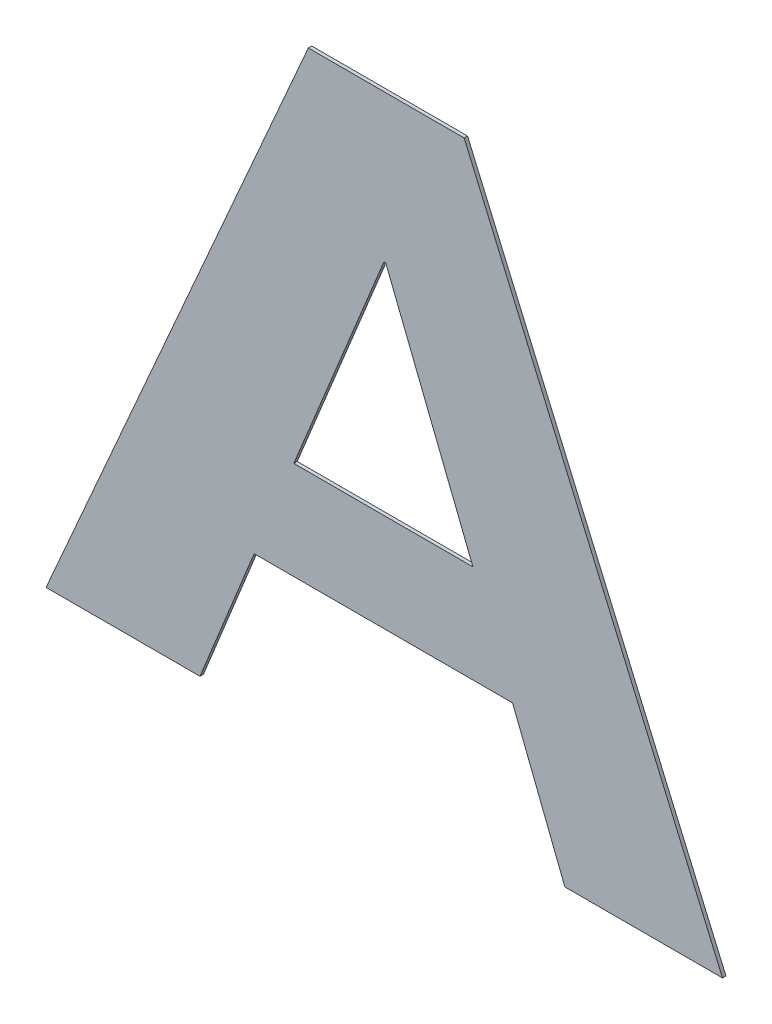
ISO-10303-21;
HEADER;
FILE_DESCRIPTION(('STEP AP214'),'2;1');
FILE_NAME('part.step','',(''),(''),'','','');
FILE_SCHEMA(('AUTOMOTIVE_DESIGN { 1 0 10303 214 1 1 1 1 }'));
ENDSEC;
DATA;
#1=APPLICATION_CONTEXT('core data for automotive mechanical design processes');
#2=APPLICATION_PROTOCOL_DEFINITION('international standard','automotive_design',2000,#1);
#3=PRODUCT_CONTEXT('',#1,'mechanical');
#4=PRODUCT('Part','Part','',(#3));
#5=PRODUCT_RELATED_PRODUCT_CATEGORY('part','',(#4));
#6=PRODUCT_DEFINITION_FORMATION('','',#4);
#7=PRODUCT_DEFINITION_CONTEXT('part definition',#1,'design');
#8=PRODUCT_DEFINITION('design','',#6,#7);
#9=PRODUCT_DEFINITION_SHAPE('','',#8);
#10=(LENGTH_UNIT() NAMED_UNIT(*) SI_UNIT(.MILLI.,.METRE.));
#11=(NAMED_UNIT(*) PLANE_ANGLE_UNIT() SI_UNIT($,.RADIAN.));
#12=(NAMED_UNIT(*) SI_UNIT($,.STERADIAN.) SOLID_ANGLE_UNIT());
#13=UNCERTAINTY_MEASURE_WITH_UNIT(LENGTH_MEASURE(1.E-05),#10,'distance_accuracy_value','');
#14=(GEOMETRIC_REPRESENTATION_CONTEXT(3) GLOBAL_UNCERTAINTY_ASSIGNED_CONTEXT((#13)) GLOBAL_UNIT_ASSIGNED_CONTEXT((#10,
#11,#12)) REPRESENTATION_CONTEXT('',''));
#15=CARTESIAN_POINT('',(0.,0.,0.));
#16=DIRECTION('',(0.,0.,1.));
#17=DIRECTION('',(1.,0.,0.));
#18=AXIS2_PLACEMENT_3D('',#15,#16,#17);
#19=CARTESIAN_POINT('',(-0.0104724210323502,0.92595557828035,0.00015));
#20=DIRECTION('',(0.,1.,0.));
#21=DIRECTION('',(0.,0.,1.));
#22=AXIS2_PLACEMENT_3D('',#19,#20,#21);
#23=PLANE('',#22);
#24=DIRECTION('',(0.,0.,1.));
#25=VECTOR('',#24,1.);
#26=CARTESIAN_POINT('',(-0.0138923976823502,0.92595557828035,0.));
#27=LINE('',#26,#25);
#28=CARTESIAN_POINT('',(-0.0138923976823502,0.92595557828035,0.));
#29=VERTEX_POINT('',#28);
#30=CARTESIAN_POINT('',(-0.0138923976823502,0.92595557828035,0.00015));
#31=VERTEX_POINT('',#30);
#32=EDGE_CURVE('E11',#29,#31,#27,.T.);
#33=ORIENTED_EDGE('',*,*,#32,.T.);
#34=DIRECTION('',(1.,0.,0.));
#35=VECTOR('',#34,1.);
#36=CARTESIAN_POINT('',(-0.0138923976823502,0.92595557828035,0.00015));
#37=LINE('',#36,#35);
#38=CARTESIAN_POINT('',(-0.00705244438235018,0.92595557828035,0.00015));
#39=VERTEX_POINT('',#38);
#40=EDGE_CURVE('E24',#31,#39,#37,.T.);
#41=ORIENTED_EDGE('',*,*,#40,.T.);
#42=DIRECTION('',(0.,0.,1.));
#43=VECTOR('',#42,1.);
#44=CARTESIAN_POINT('',(-0.00705244438235018,0.92595557828035,0.));
#45=LINE('',#44,#43);
#46=CARTESIAN_POINT('',(-0.00705244438235018,0.92595557828035,0.));
#47=VERTEX_POINT('',#46);
#48=EDGE_CURVE('E200',#47,#39,#45,.T.);
#49=ORIENTED_EDGE('',*,*,#48,.F.);
#50=DIRECTION('',(1.,0.,0.));
#51=VECTOR('',#50,1.);
#52=CARTESIAN_POINT('',(-0.0138923976823502,0.92595557828035,0.));
#53=LINE('',#52,#51);
#54=EDGE_CURVE('E197',#29,#47,#53,.T.);
#55=ORIENTED_EDGE('',*,*,#54,.F.);
#56=EDGE_LOOP('',(#33,#41,#49,#55));
#57=FACE_BOUND('',#56,.T.);
#58=ADVANCED_FACE('F17',(#57),#23,.T.);
#59=CARTESIAN_POINT('',(-0.00138070164067517,0.9128238842195,0.00015));
#60=DIRECTION('',(0.918030838804518,0.3965089898147,0.));
#61=DIRECTION('',(0.,0.,-1.));
#62=AXIS2_PLACEMENT_3D('',#59,#60,#61);
#63=PLANE('',#62);
#64=ORIENTED_EDGE('',*,*,#48,.T.);
#65=DIRECTION('',(0.3965089898147,-0.918030838804518,0.));
#66=VECTOR('',#65,1.);
#67=CARTESIAN_POINT('',(-0.00705244438235018,0.92595557828035,0.00015));
#68=LINE('',#67,#66);
#69=CARTESIAN_POINT('',(0.00429104110099982,0.89969219015865,0.00015));
#70=VERTEX_POINT('',#69);
#71=EDGE_CURVE('E195',#39,#70,#68,.T.);
#72=ORIENTED_EDGE('',*,*,#71,.T.);
#73=DIRECTION('',(0.,0.,1.));
#74=VECTOR('',#73,1.);
#75=CARTESIAN_POINT('',(0.00429104110099982,0.89969219015865,0.));
#76=LINE('',#75,#74);
#77=CARTESIAN_POINT('',(0.00429104110099982,0.89969219015865,0.));
#78=VERTEX_POINT('',#77);
#79=EDGE_CURVE('E192',#78,#70,#76,.T.);
#80=ORIENTED_EDGE('',*,*,#79,.F.);
#81=DIRECTION('',(0.3965089898147,-0.918030838804518,0.));
#82=VECTOR('',#81,1.);
#83=CARTESIAN_POINT('',(-0.00705244438235018,0.92595557828035,0.));
#84=LINE('',#83,#82);
#85=EDGE_CURVE('E189',#47,#78,#84,.T.);
#86=ORIENTED_EDGE('',*,*,#85,.F.);
#87=EDGE_LOOP('',(#64,#72,#80,#86));
#88=FACE_BOUND('',#87,.T.);
#89=ADVANCED_FACE('F207',(#88),#63,.T.);
#90=CARTESIAN_POINT('',(0.000830431859324817,0.89969219015865,0.00015));
#91=DIRECTION('',(0.,-1.,0.));
#92=DIRECTION('',(0.,0.,-1.));
#93=AXIS2_PLACEMENT_3D('',#90,#91,#92);
#94=PLANE('',#93);
#95=ORIENTED_EDGE('',*,*,#79,.T.);
#96=DIRECTION('',(-1.,0.,0.));
#97=VECTOR('',#96,1.);
#98=CARTESIAN_POINT('',(0.00429104110099982,0.89969219015865,0.00015));
#99=LINE('',#98,#97);
#100=CARTESIAN_POINT('',(-0.00263017738235018,0.89969219015865,0.00015));
#101=VERTEX_POINT('',#100);
#102=EDGE_CURVE('E187',#70,#101,#99,.T.);
#103=ORIENTED_EDGE('',*,*,#102,.T.);
#104=DIRECTION('',(0.,0.,1.));
#105=VECTOR('',#104,1.);
#106=CARTESIAN_POINT('',(-0.00263017738235018,0.89969219015865,0.));
#107=LINE('',#106,#105);
#108=CARTESIAN_POINT('',(-0.00263017738235018,0.89969219015865,0.));
#109=VERTEX_POINT('',#108);
#110=EDGE_CURVE('E184',#109,#101,#107,.T.);
#111=ORIENTED_EDGE('',*,*,#110,.F.);
#112=DIRECTION('',(-1.,0.,0.));
#113=VECTOR('',#112,1.);
#114=CARTESIAN_POINT('',(0.00429104110099982,0.89969219015865,0.));
#115=LINE('',#114,#113);
#116=EDGE_CURVE('E181',#78,#109,#115,.T.);
#117=ORIENTED_EDGE('',*,*,#116,.F.);
#118=EDGE_LOOP('',(#95,#103,#111,#117));
#119=FACE_BOUND('',#118,.T.);
#120=ADVANCED_FACE('F214',(#119),#94,.T.);
#121=CARTESIAN_POINT('',(-0.00377807111567518,0.9026167780145,0.00015));
#122=DIRECTION('',(-0.930865350415299,-0.365362421981521,0.));
#123=DIRECTION('',(0.,0.,1.));
#124=AXIS2_PLACEMENT_3D('',#121,#122,#123);
#125=PLANE('',#124);
#126=ORIENTED_EDGE('',*,*,#110,.T.);
#127=DIRECTION('',(-0.365362421981521,0.930865350415299,0.));
#128=VECTOR('',#127,1.);
#129=CARTESIAN_POINT('',(-0.00263017738235018,0.89969219015865,0.00015));
#130=LINE('',#129,#128);
#131=CARTESIAN_POINT('',(-0.00492596484900018,0.90554136587035,0.00015));
#132=VERTEX_POINT('',#131);
#133=EDGE_CURVE('E179',#101,#132,#130,.T.);
#134=ORIENTED_EDGE('',*,*,#133,.T.);
#135=DIRECTION('',(0.,0.,1.));
#136=VECTOR('',#135,1.);
#137=CARTESIAN_POINT('',(-0.00492596484900018,0.90554136587035,0.));
#138=LINE('',#137,#136);
#139=CARTESIAN_POINT('',(-0.00492596484900018,0.90554136587035,0.));
#140=VERTEX_POINT('',#139);
#141=EDGE_CURVE('E176',#140,#132,#138,.T.);
#142=ORIENTED_EDGE('',*,*,#141,.F.);
#143=DIRECTION('',(-0.365362421981521,0.930865350415299,0.));
#144=VECTOR('',#143,1.);
#145=CARTESIAN_POINT('',(-0.00263017738235018,0.89969219015865,0.));
#146=LINE('',#145,#144);
#147=EDGE_CURVE('E173',#109,#140,#146,.T.);
#148=ORIENTED_EDGE('',*,*,#147,.F.);
#149=EDGE_LOOP('',(#126,#134,#142,#148));
#150=FACE_BOUND('',#149,.T.);
#151=ADVANCED_FACE('F218',(#150),#125,.T.);
#152=CARTESIAN_POINT('',(-0.0105977075906752,0.90554136587035,0.00015));
#153=DIRECTION('',(0.,-1.,0.));
#154=DIRECTION('',(0.,0.,-1.));
#155=AXIS2_PLACEMENT_3D('',#152,#153,#154);
#156=PLANE('',#155);
#157=ORIENTED_EDGE('',*,*,#141,.T.);
#158=DIRECTION('',(-1.,0.,0.));
#159=VECTOR('',#158,1.);
#160=CARTESIAN_POINT('',(-0.00492596484900018,0.90554136587035,0.00015));
#161=LINE('',#160,#159);
#162=CARTESIAN_POINT('',(-0.0162694503323502,0.90554136587035,0.00015));
#163=VERTEX_POINT('',#162);
#164=EDGE_CURVE('E171',#132,#163,#161,.T.);
#165=ORIENTED_EDGE('',*,*,#164,.T.);
#166=DIRECTION('',(0.,0.,1.));
#167=VECTOR('',#166,1.);
#168=CARTESIAN_POINT('',(-0.0162694503323502,0.90554136587035,0.));
#169=LINE('',#168,#167);
#170=CARTESIAN_POINT('',(-0.0162694503323502,0.90554136587035,0.));
#171=VERTEX_POINT('',#170);
#172=EDGE_CURVE('E168',#171,#163,#169,.T.);
#173=ORIENTED_EDGE('',*,*,#172,.F.);
#174=DIRECTION('',(-1.,0.,0.));
#175=VECTOR('',#174,1.);
#176=CARTESIAN_POINT('',(-0.00492596484900018,0.90554136587035,0.));
#177=LINE('',#176,#175);
#178=EDGE_CURVE('E165',#140,#171,#177,.T.);
#179=ORIENTED_EDGE('',*,*,#178,.F.);
#180=EDGE_LOOP('',(#157,#165,#173,#179));
#181=FACE_BOUND('',#180,.T.);
#182=ADVANCED_FACE('F223',(#181),#156,.T.);
#183=CARTESIAN_POINT('',(-0.0174579766573502,0.9026167780145,0.00015));
#184=DIRECTION('',(0.926421005522081,-0.37648920373293,0.));
#185=DIRECTION('',(0.,0.,-1.));
#186=AXIS2_PLACEMENT_3D('',#183,#184,#185);
#187=PLANE('',#186);
#188=ORIENTED_EDGE('',*,*,#172,.T.);
#189=DIRECTION('',(-0.37648920373293,-0.926421005522081,0.));
#190=VECTOR('',#189,1.);
#191=CARTESIAN_POINT('',(-0.0162694503323502,0.90554136587035,0.00015));
#192=LINE('',#191,#190);
#193=CARTESIAN_POINT('',(-0.0186465029823502,0.89969219015865,0.00015));
#194=VERTEX_POINT('',#193);
#195=EDGE_CURVE('E163',#163,#194,#192,.T.);
#196=ORIENTED_EDGE('',*,*,#195,.T.);
#197=DIRECTION('',(0.,0.,1.));
#198=VECTOR('',#197,1.);
#199=CARTESIAN_POINT('',(-0.0186465029823502,0.89969219015865,0.));
#200=LINE('',#199,#198);
#201=CARTESIAN_POINT('',(-0.0186465029823502,0.89969219015865,0.));
#202=VERTEX_POINT('',#201);
#203=EDGE_CURVE('E160',#202,#194,#200,.T.);
#204=ORIENTED_EDGE('',*,*,#203,.F.);
#205=DIRECTION('',(-0.37648920373293,-0.926421005522081,0.));
#206=VECTOR('',#205,1.);
#207=CARTESIAN_POINT('',(-0.0162694503323502,0.90554136587035,0.));
#208=LINE('',#207,#206);
#209=EDGE_CURVE('E157',#171,#202,#208,.T.);
#210=ORIENTED_EDGE('',*,*,#209,.F.);
#211=EDGE_LOOP('',(#188,#196,#204,#210));
#212=FACE_BOUND('',#211,.T.);
#213=ADVANCED_FACE('F226',(#212),#187,.T.);
#214=CARTESIAN_POINT('',(-0.0220258470406752,0.89969219015865,0.00015));
#215=DIRECTION('',(0.,-1.,0.));
#216=DIRECTION('',(0.,0.,-1.));
#217=AXIS2_PLACEMENT_3D('',#214,#215,#216);
#218=PLANE('',#217);
#219=ORIENTED_EDGE('',*,*,#203,.T.);
#220=DIRECTION('',(-1.,0.,0.));
#221=VECTOR('',#220,1.);
#222=CARTESIAN_POINT('',(-0.0186465029823502,0.89969219015865,0.00015));
#223=LINE('',#222,#221);
#224=CARTESIAN_POINT('',(-0.0254051910990002,0.89969219015865,0.00015));
#225=VERTEX_POINT('',#224);
#226=EDGE_CURVE('E155',#194,#225,#223,.T.);
#227=ORIENTED_EDGE('',*,*,#226,.T.);
#228=DIRECTION('',(0.,0.,1.));
#229=VECTOR('',#228,1.);
#230=CARTESIAN_POINT('',(-0.0254051910990002,0.89969219015865,0.));
#231=LINE('',#230,#229);
#232=CARTESIAN_POINT('',(-0.0254051910990002,0.89969219015865,0.));
#233=VERTEX_POINT('',#232);
#234=EDGE_CURVE('E152',#233,#225,#231,.T.);
#235=ORIENTED_EDGE('',*,*,#234,.F.);
#236=DIRECTION('',(-1.,0.,0.));
#237=VECTOR('',#236,1.);
#238=CARTESIAN_POINT('',(-0.0186465029823502,0.89969219015865,0.));
#239=LINE('',#238,#237);
#240=EDGE_CURVE('E149',#202,#233,#239,.T.);
#241=ORIENTED_EDGE('',*,*,#240,.F.);
#242=EDGE_LOOP('',(#219,#227,#235,#241));
#243=FACE_BOUND('',#242,.T.);
#244=ADVANCED_FACE('F229',(#243),#218,.T.);
#245=CARTESIAN_POINT('',(-0.0196487943906752,0.9128238842195,0.00015));
#246=DIRECTION('',(-0.915868187999154,0.401479093118367,0.));
#247=DIRECTION('',(0.,0.,1.));
#248=AXIS2_PLACEMENT_3D('',#245,#246,#247);
#249=PLANE('',#248);
#250=ORIENTED_EDGE('',*,*,#234,.T.);
#251=DIRECTION('',(0.401479093118367,0.915868187999154,0.));
#252=VECTOR('',#251,1.);
#253=CARTESIAN_POINT('',(-0.0254051910990002,0.89969219015865,0.00015));
#254=LINE('',#253,#252);
#255=EDGE_CURVE('E147',#225,#31,#254,.T.);
#256=ORIENTED_EDGE('',*,*,#255,.T.);
#257=ORIENTED_EDGE('',*,*,#32,.F.);
#258=DIRECTION('',(0.401479093118367,0.915868187999154,0.));
#259=VECTOR('',#258,1.);
#260=CARTESIAN_POINT('',(-0.0254051910990002,0.89969219015865,0.));
#261=LINE('',#260,#259);
#262=EDGE_CURVE('E144',#233,#29,#261,.T.);
#263=ORIENTED_EDGE('',*,*,#262,.F.);
#264=EDGE_LOOP('',(#250,#256,#257,#263));
#265=FACE_BOUND('',#264,.T.);
#266=ADVANCED_FACE('F231',(#265),#249,.T.);
#267=CARTESIAN_POINT('',(-0.0105977075906752,0.909844441253667,0.00015));
#268=DIRECTION('',(0.,1.,0.));
#269=DIRECTION('',(0.,0.,1.));
#270=AXIS2_PLACEMENT_3D('',#267,#268,#269);
#271=PLANE('',#270);
#272=DIRECTION('',(0.,0.,1.));
#273=VECTOR('',#272,1.);
#274=CARTESIAN_POINT('',(-0.0145289872990002,0.909844441253667,0.));
#275=LINE('',#274,#273);
#276=CARTESIAN_POINT('',(-0.0145289872990002,0.909844441253667,0.));
#277=VERTEX_POINT('',#276);
#278=CARTESIAN_POINT('',(-0.0145289872990002,0.909844441253667,0.00015));
#279=VERTEX_POINT('',#278);
#280=EDGE_CURVE('E125',#277,#279,#275,.T.);
#281=ORIENTED_EDGE('',*,*,#280,.T.);
#282=DIRECTION('',(1.,0.,0.));
#283=VECTOR('',#282,1.);
#284=CARTESIAN_POINT('',(-0.0145289872990002,0.909844441253667,0.00015));
#285=LINE('',#284,#283);
#286=CARTESIAN_POINT('',(-0.00666642788235018,0.909844441253667,0.00015));
#287=VERTEX_POINT('',#286);
#288=EDGE_CURVE('E141',#279,#287,#285,.T.);
#289=ORIENTED_EDGE('',*,*,#288,.T.);
#290=DIRECTION('',(0.,0.,1.));
#291=VECTOR('',#290,1.);
#292=CARTESIAN_POINT('',(-0.00666642788235018,0.909844441253667,0.));
#293=LINE('',#292,#291);
#294=CARTESIAN_POINT('',(-0.00666642788235018,0.909844441253667,0.));
#295=VERTEX_POINT('',#294);
#296=EDGE_CURVE('E138',#295,#287,#293,.T.);
#297=ORIENTED_EDGE('',*,*,#296,.F.);
#298=DIRECTION('',(1.,0.,0.));
#299=VECTOR('',#298,1.);
#300=CARTESIAN_POINT('',(-0.0145289872990002,0.909844441253667,0.));
#301=LINE('',#300,#299);
#302=EDGE_CURVE('E136',#277,#295,#301,.T.);
#303=ORIENTED_EDGE('',*,*,#302,.F.);
#304=EDGE_LOOP('',(#281,#289,#297,#303));
#305=FACE_BOUND('',#304,.T.);
#306=ADVANCED_FACE('F233',(#305),#271,.T.);
#307=CARTESIAN_POINT('',(-0.00857958339900018,0.914662883377833,0.00015));
#308=DIRECTION('',(-0.929419584354608,-0.369024709495323,0.));
#309=DIRECTION('',(0.,0.,1.));
#310=AXIS2_PLACEMENT_3D('',#307,#308,#309);
#311=PLANE('',#310);
#312=ORIENTED_EDGE('',*,*,#296,.T.);
#313=DIRECTION('',(-0.369024709495323,0.929419584354608,0.));
#314=VECTOR('',#313,1.);
#315=CARTESIAN_POINT('',(-0.00666642788235018,0.909844441253667,0.00015));
#316=LINE('',#315,#314);
#317=CARTESIAN_POINT('',(-0.0104927389156502,0.919481325502,0.00015));
#318=VERTEX_POINT('',#317);
#319=EDGE_CURVE('E134',#287,#318,#316,.T.);
#320=ORIENTED_EDGE('',*,*,#319,.T.);
#321=DIRECTION('',(0.,0.,1.));
#322=VECTOR('',#321,1.);
#323=CARTESIAN_POINT('',(-0.0104927389156502,0.919481325502,0.));
#324=LINE('',#323,#322);
#325=CARTESIAN_POINT('',(-0.0104927389156502,0.919481325502,0.));
#326=VERTEX_POINT('',#325);
#327=EDGE_CURVE('E132',#326,#318,#324,.T.);
#328=ORIENTED_EDGE('',*,*,#327,.F.);
#329=DIRECTION('',(-0.369024709495323,0.929419584354608,0.));
#330=VECTOR('',#329,1.);
#331=CARTESIAN_POINT('',(-0.00666642788235018,0.909844441253667,0.));
#332=LINE('',#331,#330);
#333=EDGE_CURVE('E121',#295,#326,#332,.T.);
#334=ORIENTED_EDGE('',*,*,#333,.F.);
#335=EDGE_LOOP('',(#312,#320,#328,#334));
#336=FACE_BOUND('',#335,.T.);
#337=ADVANCED_FACE('F240',(#336),#311,.T.);
#338=CARTESIAN_POINT('',(-0.0105333715073252,0.919481325502,0.00015));
#339=DIRECTION('',(0.,-1.,0.));
#340=DIRECTION('',(0.,0.,-1.));
#341=AXIS2_PLACEMENT_3D('',#338,#339,#340);
#342=PLANE('',#341);
#343=ORIENTED_EDGE('',*,*,#327,.T.);
#344=DIRECTION('',(-1.,0.,0.));
#345=VECTOR('',#344,1.);
#346=CARTESIAN_POINT('',(-0.0104927389156502,0.919481325502,0.00015));
#347=LINE('',#346,#345);
#348=CARTESIAN_POINT('',(-0.0105740040990002,0.919481325502,0.00015));
#349=VERTEX_POINT('',#348);
#350=EDGE_CURVE('E108',#318,#349,#347,.T.);
#351=ORIENTED_EDGE('',*,*,#350,.T.);
#352=DIRECTION('',(0.,0.,1.));
#353=VECTOR('',#352,1.);
#354=CARTESIAN_POINT('',(-0.0105740040990002,0.919481325502,0.));
#355=LINE('',#354,#353);
#356=CARTESIAN_POINT('',(-0.0105740040990002,0.919481325502,0.));
#357=VERTEX_POINT('',#356);
#358=EDGE_CURVE('E102',#357,#349,#355,.T.);
#359=ORIENTED_EDGE('',*,*,#358,.F.);
#360=DIRECTION('',(-1.,0.,0.));
#361=VECTOR('',#360,1.);
#362=CARTESIAN_POINT('',(-0.0104927389156502,0.919481325502,0.));
#363=LINE('',#362,#361);
#364=EDGE_CURVE('E106',#326,#357,#363,.T.);
#365=ORIENTED_EDGE('',*,*,#364,.F.);
#366=EDGE_LOOP('',(#343,#351,#359,#365));
#367=FACE_BOUND('',#366,.T.);
#368=ADVANCED_FACE('F105',(#367),#342,.T.);
#369=CARTESIAN_POINT('',(-0.0125514956990002,0.914662883377833,0.00015));
#370=DIRECTION('',(0.925121765742887,-0.379670539479642,0.));
#371=DIRECTION('',(0.,0.,-1.));
#372=AXIS2_PLACEMENT_3D('',#369,#370,#371);
#373=PLANE('',#372);
#374=ORIENTED_EDGE('',*,*,#358,.T.);
#375=DIRECTION('',(-0.379670539479642,-0.925121765742887,0.));
#376=VECTOR('',#375,1.);
#377=CARTESIAN_POINT('',(-0.0105740040990002,0.919481325502,0.00015));
#378=LINE('',#377,#376);
#379=EDGE_CURVE('E122',#349,#279,#378,.T.);
#380=ORIENTED_EDGE('',*,*,#379,.T.);
#381=ORIENTED_EDGE('',*,*,#280,.F.);
#382=DIRECTION('',(-0.379670539479642,-0.925121765742887,0.));
#383=VECTOR('',#382,1.);
#384=CARTESIAN_POINT('',(-0.0105740040990002,0.919481325502,0.));
#385=LINE('',#384,#383);
#386=EDGE_CURVE('E119',#357,#277,#385,.T.);
#387=ORIENTED_EDGE('',*,*,#386,.F.);
#388=EDGE_LOOP('',(#374,#380,#381,#387));
#389=FACE_BOUND('',#388,.T.);
#390=ADVANCED_FACE('F124',(#389),#373,.T.);
#391=CARTESIAN_POINT('',(-0.0105570749990002,0.89969219015865,0.));
#392=DIRECTION('',(0.,0.,1.));
#393=DIRECTION('',(1.,0.,0.));
#394=AXIS2_PLACEMENT_3D('',#391,#392,#393);
#395=PLANE('',#394);
#396=ORIENTED_EDGE('',*,*,#54,.T.);
#397=ORIENTED_EDGE('',*,*,#85,.T.);
#398=ORIENTED_EDGE('',*,*,#116,.T.);
#399=ORIENTED_EDGE('',*,*,#147,.T.);
#400=ORIENTED_EDGE('',*,*,#178,.T.);
#401=ORIENTED_EDGE('',*,*,#209,.T.);
#402=ORIENTED_EDGE('',*,*,#240,.T.);
#403=ORIENTED_EDGE('',*,*,#262,.T.);
#404=EDGE_LOOP('',(#396,#397,#398,#399,#400,#401,#402,#403));
#405=FACE_BOUND('',#404,.T.);
#406=ORIENTED_EDGE('',*,*,#302,.T.);
#407=ORIENTED_EDGE('',*,*,#333,.T.);
#408=ORIENTED_EDGE('',*,*,#364,.T.);
#409=ORIENTED_EDGE('',*,*,#386,.T.);
#410=EDGE_LOOP('',(#406,#407,#408,#409));
#411=FACE_BOUND('',#410,.T.);
#412=ADVANCED_FACE('F118',(#405,#411),#395,.F.);
#413=CARTESIAN_POINT('',(-0.0105570749990002,0.89969219015865,0.00015));
#414=DIRECTION('',(0.,0.,1.));
#415=DIRECTION('',(1.,0.,0.));
#416=AXIS2_PLACEMENT_3D('',#413,#414,#415);
#417=PLANE('',#416);
#418=ORIENTED_EDGE('',*,*,#40,.F.);
#419=ORIENTED_EDGE('',*,*,#255,.F.);
#420=ORIENTED_EDGE('',*,*,#226,.F.);
#421=ORIENTED_EDGE('',*,*,#195,.F.);
#422=ORIENTED_EDGE('',*,*,#164,.F.);
#423=ORIENTED_EDGE('',*,*,#133,.F.);
#424=ORIENTED_EDGE('',*,*,#102,.F.);
#425=ORIENTED_EDGE('',*,*,#71,.F.);
#426=EDGE_LOOP('',(#418,#419,#420,#421,#422,#423,#424,#425));
#427=FACE_BOUND('',#426,.T.);
#428=ORIENTED_EDGE('',*,*,#288,.F.);
#429=ORIENTED_EDGE('',*,*,#379,.F.);
#430=ORIENTED_EDGE('',*,*,#350,.F.);
#431=ORIENTED_EDGE('',*,*,#319,.F.);
#432=EDGE_LOOP('',(#428,#429,#430,#431));
#433=FACE_BOUND('',#432,.T.);
#434=ADVANCED_FACE('F209',(#427,#433),#417,.T.);
#435=CLOSED_SHELL('',(#58,#89,#120,#151,#182,#213,#244,#266,#306,#337,#368,#390,#412,#434));
#436=MANIFOLD_SOLID_BREP('B1',#435);
#437=ADVANCED_BREP_SHAPE_REPRESENTATION('',(#18,#436),#14);
#438=SHAPE_DEFINITION_REPRESENTATION(#9,#437);
ENDSEC;
END-ISO-10303-21;
